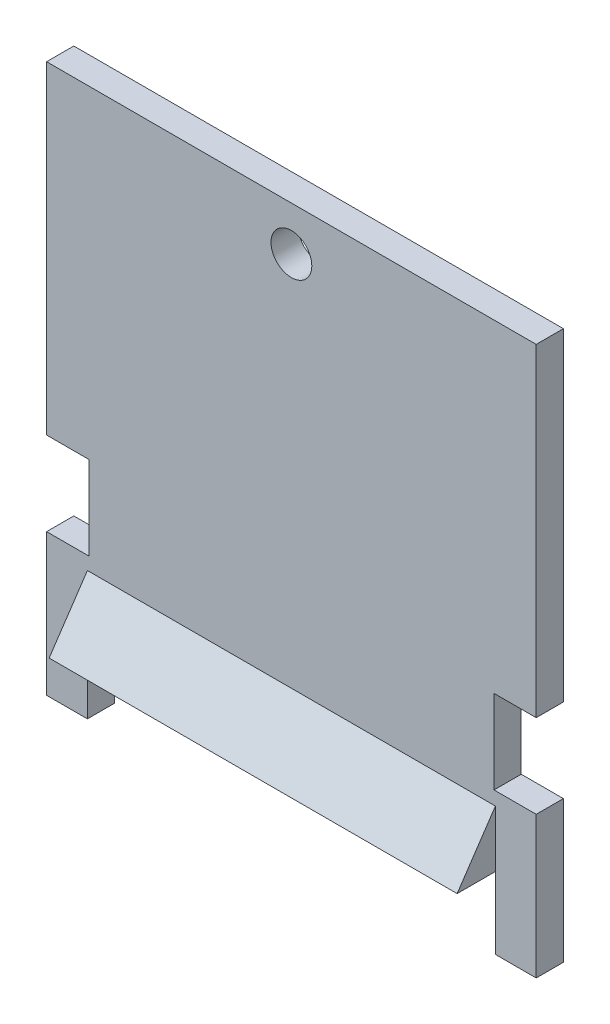
ISO-10303-21;
HEADER;
FILE_DESCRIPTION(('STEP AP214'),'2;1');
FILE_NAME('part.step','',(''),(''),'','','');
FILE_SCHEMA(('AUTOMOTIVE_DESIGN { 1 0 10303 214 1 1 1 1 }'));
ENDSEC;
DATA;
#1=APPLICATION_CONTEXT('core data for automotive mechanical design processes');
#2=APPLICATION_PROTOCOL_DEFINITION('international standard','automotive_design',2000,#1);
#3=PRODUCT_CONTEXT('',#1,'mechanical');
#4=PRODUCT('Part','Part','',(#3));
#5=PRODUCT_RELATED_PRODUCT_CATEGORY('part','',(#4));
#6=PRODUCT_DEFINITION_FORMATION('','',#4);
#7=PRODUCT_DEFINITION_CONTEXT('part definition',#1,'design');
#8=PRODUCT_DEFINITION('design','',#6,#7);
#9=PRODUCT_DEFINITION_SHAPE('','',#8);
#10=(LENGTH_UNIT() NAMED_UNIT(*) SI_UNIT(.MILLI.,.METRE.));
#11=(NAMED_UNIT(*) PLANE_ANGLE_UNIT() SI_UNIT($,.RADIAN.));
#12=(NAMED_UNIT(*) SI_UNIT($,.STERADIAN.) SOLID_ANGLE_UNIT());
#13=UNCERTAINTY_MEASURE_WITH_UNIT(LENGTH_MEASURE(1.E-05),#10,'distance_accuracy_value','');
#14=(GEOMETRIC_REPRESENTATION_CONTEXT(3) GLOBAL_UNCERTAINTY_ASSIGNED_CONTEXT((#13)) GLOBAL_UNIT_ASSIGNED_CONTEXT((#10,
#11,#12)) REPRESENTATION_CONTEXT('',''));
#15=CARTESIAN_POINT('',(0.,0.,0.));
#16=DIRECTION('',(0.,0.,1.));
#17=DIRECTION('',(1.,0.,0.));
#18=AXIS2_PLACEMENT_3D('',#15,#16,#17);
#19=CARTESIAN_POINT('',(-18.,0.,0.));
#20=DIRECTION('',(1.,0.,0.));
#21=DIRECTION('',(0.,0.,-1.));
#22=AXIS2_PLACEMENT_3D('',#19,#20,#21);
#23=PLANE('',#22);
#24=DIRECTION('',(0.,-1.,0.));
#25=VECTOR('',#24,1.);
#26=CARTESIAN_POINT('',(-18.,2.78,2.));
#27=LINE('',#26,#25);
#28=CARTESIAN_POINT('',(-18.,10.425,2.));
#29=VERTEX_POINT('',#28);
#30=CARTESIAN_POINT('',(-18.,0.,2.));
#31=VERTEX_POINT('',#30);
#32=EDGE_CURVE('E248',#29,#31,#27,.T.);
#33=ORIENTED_EDGE('',*,*,#32,.F.);
#34=DIRECTION('',(0.,0.,-1.));
#35=VECTOR('',#34,1.);
#36=CARTESIAN_POINT('',(-18.,10.425,0.));
#37=LINE('',#36,#35);
#38=CARTESIAN_POINT('',(-18.,10.425,0.));
#39=VERTEX_POINT('',#38);
#40=EDGE_CURVE('E295',#29,#39,#37,.T.);
#41=ORIENTED_EDGE('',*,*,#40,.T.);
#42=DIRECTION('',(0.,1.,0.));
#43=VECTOR('',#42,1.);
#44=CARTESIAN_POINT('',(-18.,0.,0.));
#45=LINE('',#44,#43);
#46=CARTESIAN_POINT('',(-18.,0.,0.));
#47=VERTEX_POINT('',#46);
#48=EDGE_CURVE('E263',#47,#39,#45,.T.);
#49=ORIENTED_EDGE('',*,*,#48,.F.);
#50=DIRECTION('',(0.,0.,-1.));
#51=VECTOR('',#50,1.);
#52=CARTESIAN_POINT('',(-18.,0.,2.));
#53=LINE('',#52,#51);
#54=EDGE_CURVE('E259',#31,#47,#53,.T.);
#55=ORIENTED_EDGE('',*,*,#54,.F.);
#56=EDGE_LOOP('',(#33,#41,#49,#55));
#57=FACE_BOUND('',#56,.T.);
#58=ADVANCED_FACE('F35',(#57),#23,.F.);
#59=CARTESIAN_POINT('',(18.,9.45,2.));
#60=DIRECTION('',(0.,-0.559280729804026,-0.828978326176189));
#61=DIRECTION('',(0.,0.828978326176189,-0.559280729804026));
#62=AXIS2_PLACEMENT_3D('',#59,#60,#61);
#63=PLANE('',#62);
#64=DIRECTION('',(0.,0.828978326176189,-0.559280729804026));
#65=VECTOR('',#64,1.);
#66=CARTESIAN_POINT('',(-15.,9.45000000000001,1.99999999999999));
#67=LINE('',#66,#65);
#68=CARTESIAN_POINT('',(-15.,5.28,4.81334332833583));
#69=VERTEX_POINT('',#68);
#70=CARTESIAN_POINT('',(-15.,9.45,1.99999999999999));
#71=VERTEX_POINT('',#70);
#72=EDGE_CURVE('E198',#69,#71,#67,.T.);
#73=ORIENTED_EDGE('',*,*,#72,.F.);
#74=DIRECTION('',(1.,0.,0.));
#75=VECTOR('',#74,1.);
#76=CARTESIAN_POINT('',(18.,5.27999999999998,4.81334332833584));
#77=LINE('',#76,#75);
#78=CARTESIAN_POINT('',(15.,5.27999999999999,4.81334332833584));
#79=VERTEX_POINT('',#78);
#80=EDGE_CURVE('E49',#69,#79,#77,.T.);
#81=ORIENTED_EDGE('',*,*,#80,.T.);
#82=DIRECTION('',(0.,-0.828978326176189,0.559280729804026));
#83=VECTOR('',#82,1.);
#84=CARTESIAN_POINT('',(15.,9.45,2.));
#85=LINE('',#84,#83);
#86=CARTESIAN_POINT('',(15.,9.45,1.99999999999999));
#87=VERTEX_POINT('',#86);
#88=EDGE_CURVE('E193',#87,#79,#85,.T.);
#89=ORIENTED_EDGE('',*,*,#88,.F.);
#90=DIRECTION('',(-1.,0.,0.));
#91=VECTOR('',#90,1.);
#92=CARTESIAN_POINT('',(18.,9.45,2.));
#93=LINE('',#92,#91);
#94=EDGE_CURVE('E276',#87,#71,#93,.T.);
#95=ORIENTED_EDGE('',*,*,#94,.T.);
#96=EDGE_LOOP('',(#73,#81,#89,#95));
#97=FACE_BOUND('',#96,.T.);
#98=ADVANCED_FACE('F362',(#97),#63,.F.);
#99=CARTESIAN_POINT('',(18.,0.,0.));
#100=DIRECTION('',(1.,0.,0.));
#101=DIRECTION('',(0.,0.,-1.));
#102=AXIS2_PLACEMENT_3D('',#99,#100,#101);
#103=PLANE('',#102);
#104=DIRECTION('',(0.,0.,1.));
#105=VECTOR('',#104,1.);
#106=CARTESIAN_POINT('',(18.,16.575,0.));
#107=LINE('',#106,#105);
#108=CARTESIAN_POINT('',(18.,16.575,0.));
#109=VERTEX_POINT('',#108);
#110=CARTESIAN_POINT('',(18.,16.575,2.));
#111=VERTEX_POINT('',#110);
#112=EDGE_CURVE('E300',#109,#111,#107,.T.);
#113=ORIENTED_EDGE('',*,*,#112,.F.);
#114=DIRECTION('',(0.,1.,0.));
#115=VECTOR('',#114,1.);
#116=CARTESIAN_POINT('',(18.,0.,0.));
#117=LINE('',#116,#115);
#118=CARTESIAN_POINT('',(18.,40.35,0.));
#119=VERTEX_POINT('',#118);
#120=EDGE_CURVE('E247',#109,#119,#117,.T.);
#121=ORIENTED_EDGE('',*,*,#120,.T.);
#122=DIRECTION('',(0.,0.,1.));
#123=VECTOR('',#122,1.);
#124=CARTESIAN_POINT('',(18.,40.35,0.));
#125=LINE('',#124,#123);
#126=CARTESIAN_POINT('',(18.,40.35,2.));
#127=VERTEX_POINT('',#126);
#128=EDGE_CURVE('E252',#119,#127,#125,.T.);
#129=ORIENTED_EDGE('',*,*,#128,.T.);
#130=DIRECTION('',(0.,-1.,0.));
#131=VECTOR('',#130,1.);
#132=CARTESIAN_POINT('',(18.,40.35,2.));
#133=LINE('',#132,#131);
#134=EDGE_CURVE('E254',#127,#111,#133,.T.);
#135=ORIENTED_EDGE('',*,*,#134,.T.);
#136=EDGE_LOOP('',(#113,#121,#129,#135));
#137=FACE_BOUND('',#136,.T.);
#138=ADVANCED_FACE('F326',(#137),#103,.T.);
#139=CARTESIAN_POINT('',(18.,0.,2.));
#140=DIRECTION('',(0.,1.,0.));
#141=DIRECTION('',(0.,0.,1.));
#142=AXIS2_PLACEMENT_3D('',#139,#140,#141);
#143=PLANE('',#142);
#144=DIRECTION('',(-1.,0.,0.));
#145=VECTOR('',#144,1.);
#146=CARTESIAN_POINT('',(18.,0.,2.));
#147=LINE('',#146,#145);
#148=CARTESIAN_POINT('',(18.,0.,2.));
#149=VERTEX_POINT('',#148);
#150=CARTESIAN_POINT('',(15.,0.,2.));
#151=VERTEX_POINT('',#150);
#152=EDGE_CURVE('E273',#149,#151,#147,.T.);
#153=ORIENTED_EDGE('',*,*,#152,.T.);
#154=DIRECTION('',(0.,0.,-1.));
#155=VECTOR('',#154,1.);
#156=CARTESIAN_POINT('',(15.,0.,6.5));
#157=LINE('',#156,#155);
#158=CARTESIAN_POINT('',(15.,0.,0.));
#159=VERTEX_POINT('',#158);
#160=EDGE_CURVE('E237',#151,#159,#157,.T.);
#161=ORIENTED_EDGE('',*,*,#160,.T.);
#162=DIRECTION('',(-1.,0.,0.));
#163=VECTOR('',#162,1.);
#164=CARTESIAN_POINT('',(18.,0.,0.));
#165=LINE('',#164,#163);
#166=CARTESIAN_POINT('',(18.,0.,0.));
#167=VERTEX_POINT('',#166);
#168=EDGE_CURVE('E168',#167,#159,#165,.T.);
#169=ORIENTED_EDGE('',*,*,#168,.F.);
#170=DIRECTION('',(0.,0.,-1.));
#171=VECTOR('',#170,1.);
#172=CARTESIAN_POINT('',(18.,0.,2.));
#173=LINE('',#172,#171);
#174=EDGE_CURVE('E244',#149,#167,#173,.T.);
#175=ORIENTED_EDGE('',*,*,#174,.F.);
#176=EDGE_LOOP('',(#153,#161,#169,#175));
#177=FACE_BOUND('',#176,.T.);
#178=ADVANCED_FACE('F396',(#177),#143,.F.);
#179=CARTESIAN_POINT('',(-15.,0.,0.));
#180=VERTEX_POINT('',#179);
#181=EDGE_CURVE('E285',#180,#47,#165,.T.);
#182=ORIENTED_EDGE('',*,*,#181,.F.);
#183=DIRECTION('',(0.,0.,-1.));
#184=VECTOR('',#183,1.);
#185=CARTESIAN_POINT('',(-15.,0.,6.5));
#186=LINE('',#185,#184);
#187=CARTESIAN_POINT('',(-15.,0.,2.));
#188=VERTEX_POINT('',#187);
#189=EDGE_CURVE('E238',#188,#180,#186,.T.);
#190=ORIENTED_EDGE('',*,*,#189,.F.);
#191=EDGE_CURVE('E258',#188,#31,#147,.T.);
#192=ORIENTED_EDGE('',*,*,#191,.T.);
#193=ORIENTED_EDGE('',*,*,#54,.T.);
#194=EDGE_LOOP('',(#182,#190,#192,#193));
#195=FACE_BOUND('',#194,.T.);
#196=ADVANCED_FACE('F37',(#195),#143,.F.);
#197=CARTESIAN_POINT('',(18.,0.,0.));
#198=DIRECTION('',(0.,0.,1.));
#199=DIRECTION('',(0.,-1.,0.));
#200=AXIS2_PLACEMENT_3D('',#197,#198,#199);
#201=PLANE('',#200);
#202=DIRECTION('',(0.,-1.,0.));
#203=VECTOR('',#202,1.);
#204=CARTESIAN_POINT('',(15.,0.,0.));
#205=LINE('',#204,#203);
#206=CARTESIAN_POINT('',(15.,5.27999999999999,0.));
#207=VERTEX_POINT('',#206);
#208=EDGE_CURVE('E160',#207,#159,#205,.T.);
#209=ORIENTED_EDGE('',*,*,#208,.F.);
#210=DIRECTION('',(-1.,0.,0.));
#211=VECTOR('',#210,1.);
#212=CARTESIAN_POINT('',(21.9641941385921,5.27999999999998,0.));
#213=LINE('',#212,#211);
#214=CARTESIAN_POINT('',(-15.,5.28,0.));
#215=VERTEX_POINT('',#214);
#216=EDGE_CURVE('E166',#207,#215,#213,.T.);
#217=ORIENTED_EDGE('',*,*,#216,.T.);
#218=DIRECTION('',(0.,1.,0.));
#219=VECTOR('',#218,1.);
#220=CARTESIAN_POINT('',(-15.,0.,0.));
#221=LINE('',#220,#219);
#222=EDGE_CURVE('E171',#180,#215,#221,.T.);
#223=ORIENTED_EDGE('',*,*,#222,.F.);
#224=ORIENTED_EDGE('',*,*,#181,.T.);
#225=ORIENTED_EDGE('',*,*,#48,.T.);
#226=DIRECTION('',(-1.,0.,0.));
#227=VECTOR('',#226,1.);
#228=CARTESIAN_POINT('',(-18.,10.425,0.));
#229=LINE('',#228,#227);
#230=CARTESIAN_POINT('',(-14.9,10.425,0.));
#231=VERTEX_POINT('',#230);
#232=EDGE_CURVE('E221',#231,#39,#229,.T.);
#233=ORIENTED_EDGE('',*,*,#232,.F.);
#234=DIRECTION('',(0.,-1.,0.));
#235=VECTOR('',#234,1.);
#236=CARTESIAN_POINT('',(-14.9,16.575,0.));
#237=LINE('',#236,#235);
#238=CARTESIAN_POINT('',(-14.9,16.575,0.));
#239=VERTEX_POINT('',#238);
#240=EDGE_CURVE('E218',#239,#231,#237,.T.);
#241=ORIENTED_EDGE('',*,*,#240,.F.);
#242=DIRECTION('',(1.,0.,0.));
#243=VECTOR('',#242,1.);
#244=CARTESIAN_POINT('',(-18.,16.575,0.));
#245=LINE('',#244,#243);
#246=CARTESIAN_POINT('',(-18.,16.575,0.));
#247=VERTEX_POINT('',#246);
#248=EDGE_CURVE('E201',#247,#239,#245,.T.);
#249=ORIENTED_EDGE('',*,*,#248,.F.);
#250=CARTESIAN_POINT('',(-18.,40.35,0.));
#251=VERTEX_POINT('',#250);
#252=EDGE_CURVE('E262',#247,#251,#45,.T.);
#253=ORIENTED_EDGE('',*,*,#252,.T.);
#254=DIRECTION('',(-1.,0.,0.));
#255=VECTOR('',#254,1.);
#256=CARTESIAN_POINT('',(18.,40.35,0.));
#257=LINE('',#256,#255);
#258=EDGE_CURVE('E282',#119,#251,#257,.T.);
#259=ORIENTED_EDGE('',*,*,#258,.F.);
#260=ORIENTED_EDGE('',*,*,#120,.F.);
#261=DIRECTION('',(1.,0.,0.));
#262=VECTOR('',#261,1.);
#263=CARTESIAN_POINT('',(18.,16.575,0.));
#264=LINE('',#263,#262);
#265=CARTESIAN_POINT('',(14.9,16.575,0.));
#266=VERTEX_POINT('',#265);
#267=EDGE_CURVE('E209',#266,#109,#264,.T.);
#268=ORIENTED_EDGE('',*,*,#267,.F.);
#269=DIRECTION('',(0.,1.,0.));
#270=VECTOR('',#269,1.);
#271=CARTESIAN_POINT('',(14.9,16.575,0.));
#272=LINE('',#271,#270);
#273=CARTESIAN_POINT('',(14.9,10.425,0.));
#274=VERTEX_POINT('',#273);
#275=EDGE_CURVE('E205',#274,#266,#272,.T.);
#276=ORIENTED_EDGE('',*,*,#275,.F.);
#277=DIRECTION('',(-1.,0.,0.));
#278=VECTOR('',#277,1.);
#279=CARTESIAN_POINT('',(18.,10.425,0.));
#280=LINE('',#279,#278);
#281=CARTESIAN_POINT('',(18.,10.425,0.));
#282=VERTEX_POINT('',#281);
#283=EDGE_CURVE('E202',#282,#274,#280,.T.);
#284=ORIENTED_EDGE('',*,*,#283,.F.);
#285=EDGE_CURVE('E249',#167,#282,#117,.T.);
#286=ORIENTED_EDGE('',*,*,#285,.F.);
#287=ORIENTED_EDGE('',*,*,#168,.T.);
#288=EDGE_LOOP('',(#209,#217,#223,#224,#225,#233,#241,#249,#253,#259,#260,#268,#276,#284,#286,#287));
#289=FACE_BOUND('',#288,.T.);
#290=CARTESIAN_POINT('',(0.,37.1,0.));
#291=DIRECTION('',(0.,0.,-1.));
#292=DIRECTION('',(-1.,0.,0.));
#293=AXIS2_PLACEMENT_3D('',#290,#291,#292);
#294=CIRCLE('',#293,1.5);
#295=CARTESIAN_POINT('',(-1.5,37.1,0.));
#296=VERTEX_POINT('',#295);
#297=EDGE_CURVE('E172',#296,#296,#294,.T.);
#298=ORIENTED_EDGE('',*,*,#297,.F.);
#299=EDGE_LOOP('',(#298));
#300=FACE_BOUND('',#299,.T.);
#301=ADVANCED_FACE('F162',(#289,#300),#201,.F.);
#302=CARTESIAN_POINT('',(18.,40.35,0.));
#303=DIRECTION('',(0.,-1.,0.));
#304=DIRECTION('',(0.,0.,-1.));
#305=AXIS2_PLACEMENT_3D('',#302,#303,#304);
#306=PLANE('',#305);
#307=DIRECTION('',(0.,0.,1.));
#308=VECTOR('',#307,1.);
#309=CARTESIAN_POINT('',(-18.,40.35,0.));
#310=LINE('',#309,#308);
#311=CARTESIAN_POINT('',(-18.,40.35,2.));
#312=VERTEX_POINT('',#311);
#313=EDGE_CURVE('E266',#251,#312,#310,.T.);
#314=ORIENTED_EDGE('',*,*,#313,.T.);
#315=DIRECTION('',(-1.,0.,0.));
#316=VECTOR('',#315,1.);
#317=CARTESIAN_POINT('',(18.,40.35,2.));
#318=LINE('',#317,#316);
#319=EDGE_CURVE('E279',#127,#312,#318,.T.);
#320=ORIENTED_EDGE('',*,*,#319,.F.);
#321=ORIENTED_EDGE('',*,*,#128,.F.);
#322=ORIENTED_EDGE('',*,*,#258,.T.);
#323=EDGE_LOOP('',(#314,#320,#321,#322));
#324=FACE_BOUND('',#323,.T.);
#325=ADVANCED_FACE('F393',(#324),#306,.F.);
#326=CARTESIAN_POINT('',(18.,2.78,2.));
#327=DIRECTION('',(0.,0.,-1.));
#328=DIRECTION('',(-1.,0.,0.));
#329=AXIS2_PLACEMENT_3D('',#326,#327,#328);
#330=PLANE('',#329);
#331=ORIENTED_EDGE('',*,*,#191,.F.);
#332=DIRECTION('',(0.,1.,0.));
#333=VECTOR('',#332,1.);
#334=CARTESIAN_POINT('',(-15.,2.78,2.));
#335=LINE('',#334,#333);
#336=CARTESIAN_POINT('',(-15.,5.28,1.99999999999999));
#337=VERTEX_POINT('',#336);
#338=EDGE_CURVE('E287',#188,#337,#335,.T.);
#339=ORIENTED_EDGE('',*,*,#338,.T.);
#340=DIRECTION('',(0.,1.,0.));
#341=VECTOR('',#340,1.);
#342=CARTESIAN_POINT('',(-15.,10.425,1.99999999999999));
#343=LINE('',#342,#341);
#344=EDGE_CURVE('E191',#337,#71,#343,.T.);
#345=ORIENTED_EDGE('',*,*,#344,.T.);
#346=ORIENTED_EDGE('',*,*,#94,.F.);
#347=DIRECTION('',(0.,-1.,0.));
#348=VECTOR('',#347,1.);
#349=CARTESIAN_POINT('',(15.,10.425,1.99999999999999));
#350=LINE('',#349,#348);
#351=CARTESIAN_POINT('',(15.,5.27999999999999,1.99999999999999));
#352=VERTEX_POINT('',#351);
#353=EDGE_CURVE('E187',#87,#352,#350,.T.);
#354=ORIENTED_EDGE('',*,*,#353,.T.);
#355=DIRECTION('',(0.,-1.,0.));
#356=VECTOR('',#355,1.);
#357=CARTESIAN_POINT('',(15.,2.78,2.));
#358=LINE('',#357,#356);
#359=EDGE_CURVE('E178',#352,#151,#358,.T.);
#360=ORIENTED_EDGE('',*,*,#359,.T.);
#361=ORIENTED_EDGE('',*,*,#152,.F.);
#362=DIRECTION('',(0.,-1.,0.));
#363=VECTOR('',#362,1.);
#364=CARTESIAN_POINT('',(18.,2.78,2.));
#365=LINE('',#364,#363);
#366=CARTESIAN_POINT('',(18.,10.425,2.));
#367=VERTEX_POINT('',#366);
#368=EDGE_CURVE('E57',#367,#149,#365,.T.);
#369=ORIENTED_EDGE('',*,*,#368,.F.);
#370=DIRECTION('',(-1.,0.,0.));
#371=VECTOR('',#370,1.);
#372=CARTESIAN_POINT('',(18.,10.425,2.));
#373=LINE('',#372,#371);
#374=CARTESIAN_POINT('',(14.9,10.425,2.));
#375=VERTEX_POINT('',#374);
#376=EDGE_CURVE('E231',#367,#375,#373,.T.);
#377=ORIENTED_EDGE('',*,*,#376,.T.);
#378=DIRECTION('',(0.,1.,0.));
#379=VECTOR('',#378,1.);
#380=CARTESIAN_POINT('',(14.9,40.35,2.));
#381=LINE('',#380,#379);
#382=CARTESIAN_POINT('',(14.9,16.575,2.));
#383=VERTEX_POINT('',#382);
#384=EDGE_CURVE('E43',#375,#383,#381,.T.);
#385=ORIENTED_EDGE('',*,*,#384,.T.);
#386=DIRECTION('',(1.,0.,0.));
#387=VECTOR('',#386,1.);
#388=CARTESIAN_POINT('',(18.,16.575,2.));
#389=LINE('',#388,#387);
#390=EDGE_CURVE('E233',#383,#111,#389,.T.);
#391=ORIENTED_EDGE('',*,*,#390,.T.);
#392=ORIENTED_EDGE('',*,*,#134,.F.);
#393=ORIENTED_EDGE('',*,*,#319,.T.);
#394=DIRECTION('',(0.,-1.,0.));
#395=VECTOR('',#394,1.);
#396=CARTESIAN_POINT('',(-18.,40.35,2.));
#397=LINE('',#396,#395);
#398=CARTESIAN_POINT('',(-18.,16.575,2.));
#399=VERTEX_POINT('',#398);
#400=EDGE_CURVE('E268',#312,#399,#397,.T.);
#401=ORIENTED_EDGE('',*,*,#400,.T.);
#402=DIRECTION('',(1.,0.,0.));
#403=VECTOR('',#402,1.);
#404=CARTESIAN_POINT('',(18.,16.5750000000001,2.));
#405=LINE('',#404,#403);
#406=CARTESIAN_POINT('',(-14.9,16.575,2.));
#407=VERTEX_POINT('',#406);
#408=EDGE_CURVE('E214',#399,#407,#405,.T.);
#409=ORIENTED_EDGE('',*,*,#408,.T.);
#410=DIRECTION('',(0.,-1.,0.));
#411=VECTOR('',#410,1.);
#412=CARTESIAN_POINT('',(-14.9,40.35,2.));
#413=LINE('',#412,#411);
#414=CARTESIAN_POINT('',(-14.9,10.425,2.));
#415=VERTEX_POINT('',#414);
#416=EDGE_CURVE('E302',#407,#415,#413,.T.);
#417=ORIENTED_EDGE('',*,*,#416,.T.);
#418=DIRECTION('',(-1.,0.,0.));
#419=VECTOR('',#418,1.);
#420=CARTESIAN_POINT('',(18.,10.4250000000001,2.));
#421=LINE('',#420,#419);
#422=EDGE_CURVE('E228',#415,#29,#421,.T.);
#423=ORIENTED_EDGE('',*,*,#422,.T.);
#424=ORIENTED_EDGE('',*,*,#32,.T.);
#425=EDGE_LOOP('',(#331,#339,#345,#346,#354,#360,#361,#369,#377,#385,#391,#392,#393,#401,#409,
#417,#423,#424));
#426=FACE_BOUND('',#425,.T.);
#427=CARTESIAN_POINT('',(0.,37.1,2.));
#428=DIRECTION('',(0.,0.,-1.));
#429=DIRECTION('',(0.,1.,0.));
#430=AXIS2_PLACEMENT_3D('',#427,#428,#429);
#431=CIRCLE('',#430,1.5);
#432=CARTESIAN_POINT('',(0.,38.6,2.));
#433=VERTEX_POINT('',#432);
#434=EDGE_CURVE('E240',#433,#433,#431,.T.);
#435=ORIENTED_EDGE('',*,*,#434,.T.);
#436=EDGE_LOOP('',(#435));
#437=FACE_BOUND('',#436,.T.);
#438=ADVANCED_FACE('F307',(#426,#437),#330,.F.);
#439=DIRECTION('',(0.,0.,-1.));
#440=VECTOR('',#439,1.);
#441=CARTESIAN_POINT('',(18.,10.425,0.));
#442=LINE('',#441,#440);
#443=EDGE_CURVE('E298',#367,#282,#442,.T.);
#444=ORIENTED_EDGE('',*,*,#443,.F.);
#445=ORIENTED_EDGE('',*,*,#368,.T.);
#446=ORIENTED_EDGE('',*,*,#174,.T.);
#447=ORIENTED_EDGE('',*,*,#285,.T.);
#448=EDGE_LOOP('',(#444,#445,#446,#447));
#449=FACE_BOUND('',#448,.T.);
#450=ADVANCED_FACE('F383',(#449),#103,.T.);
#451=ORIENTED_EDGE('',*,*,#252,.F.);
#452=DIRECTION('',(0.,0.,1.));
#453=VECTOR('',#452,1.);
#454=CARTESIAN_POINT('',(-18.,16.575,0.));
#455=LINE('',#454,#453);
#456=EDGE_CURVE('E290',#247,#399,#455,.T.);
#457=ORIENTED_EDGE('',*,*,#456,.T.);
#458=ORIENTED_EDGE('',*,*,#400,.F.);
#459=ORIENTED_EDGE('',*,*,#313,.F.);
#460=EDGE_LOOP('',(#451,#457,#458,#459));
#461=FACE_BOUND('',#460,.T.);
#462=ADVANCED_FACE('F334',(#461),#23,.F.);
#463=CARTESIAN_POINT('',(15.,0.,6.5));
#464=DIRECTION('',(1.,0.,0.));
#465=DIRECTION('',(0.,0.,-1.));
#466=AXIS2_PLACEMENT_3D('',#463,#464,#465);
#467=PLANE('',#466);
#468=ORIENTED_EDGE('',*,*,#359,.F.);
#469=DIRECTION('',(0.,0.,-1.));
#470=VECTOR('',#469,1.);
#471=CARTESIAN_POINT('',(15.,5.27999999999999,6.5));
#472=LINE('',#471,#470);
#473=EDGE_CURVE('E175',#352,#207,#472,.T.);
#474=ORIENTED_EDGE('',*,*,#473,.T.);
#475=ORIENTED_EDGE('',*,*,#208,.T.);
#476=ORIENTED_EDGE('',*,*,#160,.F.);
#477=EDGE_LOOP('',(#468,#474,#475,#476));
#478=FACE_BOUND('',#477,.T.);
#479=ADVANCED_FACE('F176',(#478),#467,.F.);
#480=CARTESIAN_POINT('',(-15.,0.,6.5));
#481=DIRECTION('',(-1.,0.,0.));
#482=DIRECTION('',(0.,0.,1.));
#483=AXIS2_PLACEMENT_3D('',#480,#481,#482);
#484=PLANE('',#483);
#485=ORIENTED_EDGE('',*,*,#189,.T.);
#486=ORIENTED_EDGE('',*,*,#222,.T.);
#487=DIRECTION('',(0.,0.,-1.));
#488=VECTOR('',#487,1.);
#489=CARTESIAN_POINT('',(-15.,5.28,6.5));
#490=LINE('',#489,#488);
#491=EDGE_CURVE('E181',#337,#215,#490,.T.);
#492=ORIENTED_EDGE('',*,*,#491,.F.);
#493=ORIENTED_EDGE('',*,*,#338,.F.);
#494=EDGE_LOOP('',(#485,#486,#492,#493));
#495=FACE_BOUND('',#494,.T.);
#496=ADVANCED_FACE('F356',(#495),#484,.F.);
#497=CARTESIAN_POINT('',(0.,37.1,6.5));
#498=DIRECTION('',(0.,0.,-1.));
#499=DIRECTION('',(-1.,0.,0.));
#500=AXIS2_PLACEMENT_3D('',#497,#498,#499);
#501=CYLINDRICAL_SURFACE('',#500,1.5);
#502=ORIENTED_EDGE('',*,*,#297,.T.);
#503=EDGE_LOOP('',(#502));
#504=FACE_BOUND('',#503,.T.);
#505=ORIENTED_EDGE('',*,*,#434,.F.);
#506=EDGE_LOOP('',(#505));
#507=FACE_BOUND('',#506,.T.);
#508=ADVANCED_FACE('F439',(#504,#507),#501,.F.);
#509=CARTESIAN_POINT('',(-14.9,16.575,6.5));
#510=DIRECTION('',(1.,0.,0.));
#511=DIRECTION('',(0.,1.,0.));
#512=AXIS2_PLACEMENT_3D('',#509,#510,#511);
#513=PLANE('',#512);
#514=DIRECTION('',(0.,0.,-1.));
#515=VECTOR('',#514,1.);
#516=CARTESIAN_POINT('',(-14.9,16.575,6.5));
#517=LINE('',#516,#515);
#518=EDGE_CURVE('E223',#407,#239,#517,.T.);
#519=ORIENTED_EDGE('',*,*,#518,.T.);
#520=ORIENTED_EDGE('',*,*,#240,.T.);
#521=DIRECTION('',(0.,0.,-1.));
#522=VECTOR('',#521,1.);
#523=CARTESIAN_POINT('',(-14.9,10.425,6.5));
#524=LINE('',#523,#522);
#525=EDGE_CURVE('E206',#415,#231,#524,.T.);
#526=ORIENTED_EDGE('',*,*,#525,.F.);
#527=ORIENTED_EDGE('',*,*,#416,.F.);
#528=EDGE_LOOP('',(#519,#520,#526,#527));
#529=FACE_BOUND('',#528,.T.);
#530=ADVANCED_FACE('F343',(#529),#513,.F.);
#531=CARTESIAN_POINT('',(-18.,10.425,6.5));
#532=DIRECTION('',(0.,-1.,0.));
#533=DIRECTION('',(1.,0.,0.));
#534=AXIS2_PLACEMENT_3D('',#531,#532,#533);
#535=PLANE('',#534);
#536=ORIENTED_EDGE('',*,*,#525,.T.);
#537=ORIENTED_EDGE('',*,*,#232,.T.);
#538=ORIENTED_EDGE('',*,*,#40,.F.);
#539=ORIENTED_EDGE('',*,*,#422,.F.);
#540=EDGE_LOOP('',(#536,#537,#538,#539));
#541=FACE_BOUND('',#540,.T.);
#542=ADVANCED_FACE('F347',(#541),#535,.F.);
#543=CARTESIAN_POINT('',(-18.,16.575,6.5));
#544=DIRECTION('',(0.,1.,0.));
#545=DIRECTION('',(-1.,0.,0.));
#546=AXIS2_PLACEMENT_3D('',#543,#544,#545);
#547=PLANE('',#546);
#548=ORIENTED_EDGE('',*,*,#456,.F.);
#549=ORIENTED_EDGE('',*,*,#248,.T.);
#550=ORIENTED_EDGE('',*,*,#518,.F.);
#551=ORIENTED_EDGE('',*,*,#408,.F.);
#552=EDGE_LOOP('',(#548,#549,#550,#551));
#553=FACE_BOUND('',#552,.T.);
#554=ADVANCED_FACE('F337',(#553),#547,.F.);
#555=CARTESIAN_POINT('',(14.9,16.575,6.5));
#556=DIRECTION('',(-1.,0.,0.));
#557=DIRECTION('',(0.,-1.,0.));
#558=AXIS2_PLACEMENT_3D('',#555,#556,#557);
#559=PLANE('',#558);
#560=DIRECTION('',(0.,0.,-1.));
#561=VECTOR('',#560,1.);
#562=CARTESIAN_POINT('',(14.9,10.425,6.5));
#563=LINE('',#562,#561);
#564=EDGE_CURVE('E211',#375,#274,#563,.T.);
#565=ORIENTED_EDGE('',*,*,#564,.T.);
#566=ORIENTED_EDGE('',*,*,#275,.T.);
#567=DIRECTION('',(0.,0.,-1.));
#568=VECTOR('',#567,1.);
#569=CARTESIAN_POINT('',(14.9,16.575,6.5));
#570=LINE('',#569,#568);
#571=EDGE_CURVE('E212',#383,#266,#570,.T.);
#572=ORIENTED_EDGE('',*,*,#571,.F.);
#573=ORIENTED_EDGE('',*,*,#384,.F.);
#574=EDGE_LOOP('',(#565,#566,#572,#573));
#575=FACE_BOUND('',#574,.T.);
#576=ADVANCED_FACE('F313',(#575),#559,.F.);
#577=CARTESIAN_POINT('',(18.,16.575,6.5));
#578=DIRECTION('',(0.,1.,0.));
#579=DIRECTION('',(-1.,0.,0.));
#580=AXIS2_PLACEMENT_3D('',#577,#578,#579);
#581=PLANE('',#580);
#582=ORIENTED_EDGE('',*,*,#571,.T.);
#583=ORIENTED_EDGE('',*,*,#267,.T.);
#584=ORIENTED_EDGE('',*,*,#112,.T.);
#585=ORIENTED_EDGE('',*,*,#390,.F.);
#586=EDGE_LOOP('',(#582,#583,#584,#585));
#587=FACE_BOUND('',#586,.T.);
#588=ADVANCED_FACE('F324',(#587),#581,.F.);
#589=CARTESIAN_POINT('',(18.,10.425,6.5));
#590=DIRECTION('',(0.,-1.,0.));
#591=DIRECTION('',(0.,0.,-1.));
#592=AXIS2_PLACEMENT_3D('',#589,#590,#591);
#593=PLANE('',#592);
#594=ORIENTED_EDGE('',*,*,#443,.T.);
#595=ORIENTED_EDGE('',*,*,#283,.T.);
#596=ORIENTED_EDGE('',*,*,#564,.F.);
#597=ORIENTED_EDGE('',*,*,#376,.F.);
#598=EDGE_LOOP('',(#594,#595,#596,#597));
#599=FACE_BOUND('',#598,.T.);
#600=ADVANCED_FACE('F315',(#599),#593,.F.);
#601=CARTESIAN_POINT('',(15.,10.425,6.5));
#602=DIRECTION('',(1.,0.,0.));
#603=DIRECTION('',(0.,0.,-1.));
#604=AXIS2_PLACEMENT_3D('',#601,#602,#603);
#605=PLANE('',#604);
#606=EDGE_CURVE('E180',#79,#352,#472,.T.);
#607=ORIENTED_EDGE('',*,*,#606,.T.);
#608=ORIENTED_EDGE('',*,*,#353,.F.);
#609=ORIENTED_EDGE('',*,*,#88,.T.);
#610=EDGE_LOOP('',(#607,#608,#609));
#611=FACE_BOUND('',#610,.T.);
#612=ADVANCED_FACE('F364',(#611),#605,.T.);
#613=CARTESIAN_POINT('',(-15.,10.425,6.5));
#614=DIRECTION('',(-1.,0.,0.));
#615=DIRECTION('',(0.,-1.,0.));
#616=AXIS2_PLACEMENT_3D('',#613,#614,#615);
#617=PLANE('',#616);
#618=DIRECTION('',(0.,0.,-1.));
#619=VECTOR('',#618,1.);
#620=CARTESIAN_POINT('',(-15.,5.28,6.5));
#621=LINE('',#620,#619);
#622=EDGE_CURVE('E11',#69,#337,#621,.T.);
#623=ORIENTED_EDGE('',*,*,#622,.F.);
#624=ORIENTED_EDGE('',*,*,#72,.T.);
#625=ORIENTED_EDGE('',*,*,#344,.F.);
#626=EDGE_LOOP('',(#623,#624,#625));
#627=FACE_BOUND('',#626,.T.);
#628=ADVANCED_FACE('F359',(#627),#617,.T.);
#629=CARTESIAN_POINT('',(21.9641941385921,5.27999999999998,6.5));
#630=DIRECTION('',(0.,1.,0.));
#631=DIRECTION('',(-1.,0.,0.));
#632=AXIS2_PLACEMENT_3D('',#629,#630,#631);
#633=PLANE('',#632);
#634=ORIENTED_EDGE('',*,*,#622,.T.);
#635=ORIENTED_EDGE('',*,*,#491,.T.);
#636=ORIENTED_EDGE('',*,*,#216,.F.);
#637=ORIENTED_EDGE('',*,*,#473,.F.);
#638=ORIENTED_EDGE('',*,*,#606,.F.);
#639=ORIENTED_EDGE('',*,*,#80,.F.);
#640=EDGE_LOOP('',(#634,#635,#636,#637,#638,#639));
#641=FACE_BOUND('',#640,.T.);
#642=ADVANCED_FACE('F184',(#641),#633,.F.);
#643=CLOSED_SHELL('',(#58,#98,#138,#178,#196,#301,#325,#438,#450,#462,#479,#496,#508,#530,#542,
#554,#576,#588,#600,#612,#628,#642));
#644=MANIFOLD_SOLID_BREP('B2',#643);
#645=ADVANCED_BREP_SHAPE_REPRESENTATION('',(#18,#644),#14);
#646=SHAPE_DEFINITION_REPRESENTATION(#9,#645);
ENDSEC;
END-ISO-10303-21;
